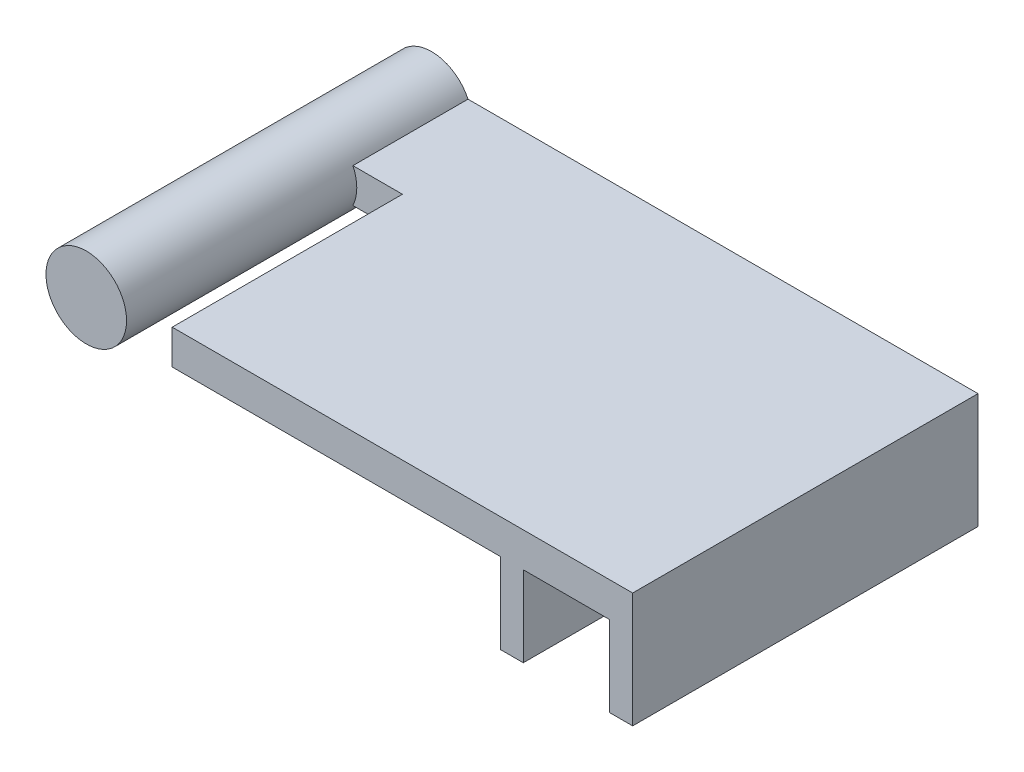
ISO-10303-21;
HEADER;
FILE_DESCRIPTION(('STEP AP214'),'2;1');
FILE_NAME('part.step','',(''),(''),'','','');
FILE_SCHEMA(('AUTOMOTIVE_DESIGN { 1 0 10303 214 1 1 1 1 }'));
ENDSEC;
DATA;
#1=APPLICATION_CONTEXT('core data for automotive mechanical design processes');
#2=APPLICATION_PROTOCOL_DEFINITION('international standard','automotive_design',2000,#1);
#3=PRODUCT_CONTEXT('',#1,'mechanical');
#4=PRODUCT('Part','Part','',(#3));
#5=PRODUCT_RELATED_PRODUCT_CATEGORY('part','',(#4));
#6=PRODUCT_DEFINITION_FORMATION('','',#4);
#7=PRODUCT_DEFINITION_CONTEXT('part definition',#1,'design');
#8=PRODUCT_DEFINITION('design','',#6,#7);
#9=PRODUCT_DEFINITION_SHAPE('','',#8);
#10=(LENGTH_UNIT() NAMED_UNIT(*) SI_UNIT(.MILLI.,.METRE.));
#11=(NAMED_UNIT(*) PLANE_ANGLE_UNIT() SI_UNIT($,.RADIAN.));
#12=(NAMED_UNIT(*) SI_UNIT($,.STERADIAN.) SOLID_ANGLE_UNIT());
#13=UNCERTAINTY_MEASURE_WITH_UNIT(LENGTH_MEASURE(1.E-05),#10,'distance_accuracy_value','');
#14=(GEOMETRIC_REPRESENTATION_CONTEXT(3) GLOBAL_UNCERTAINTY_ASSIGNED_CONTEXT((#13)) GLOBAL_UNIT_ASSIGNED_CONTEXT((#10,
#11,#12)) REPRESENTATION_CONTEXT('',''));
#15=CARTESIAN_POINT('',(0.,0.,0.));
#16=DIRECTION('',(0.,0.,1.));
#17=DIRECTION('',(1.,0.,0.));
#18=AXIS2_PLACEMENT_3D('',#15,#16,#17);
#19=CARTESIAN_POINT('',(-20.,1.5,30.));
#20=DIRECTION('',(0.,-1.,0.));
#21=DIRECTION('',(0.,0.,-1.));
#22=AXIS2_PLACEMENT_3D('',#19,#20,#21);
#23=PLANE('',#22);
#24=DIRECTION('',(0.,0.,-1.));
#25=VECTOR('',#24,1.);
#26=CARTESIAN_POINT('',(-24.3028652580677,1.5,30.));
#27=LINE('',#26,#25);
#28=CARTESIAN_POINT('',(-24.3028652580677,1.5,10.));
#29=VERTEX_POINT('',#28);
#30=CARTESIAN_POINT('',(-24.3028652580677,1.5,0.));
#31=VERTEX_POINT('',#30);
#32=EDGE_CURVE('E119',#29,#31,#27,.T.);
#33=ORIENTED_EDGE('',*,*,#32,.F.);
#34=DIRECTION('',(-1.,0.,0.));
#35=VECTOR('',#34,1.);
#36=CARTESIAN_POINT('',(-20.,1.5,10.));
#37=LINE('',#36,#35);
#38=CARTESIAN_POINT('',(-20.,1.5,10.));
#39=VERTEX_POINT('',#38);
#40=EDGE_CURVE('E144',#39,#29,#37,.T.);
#41=ORIENTED_EDGE('',*,*,#40,.F.);
#42=DIRECTION('',(0.,0.,-1.));
#43=VECTOR('',#42,1.);
#44=CARTESIAN_POINT('',(-20.,1.5,30.));
#45=LINE('',#44,#43);
#46=CARTESIAN_POINT('',(-20.,1.5,30.));
#47=VERTEX_POINT('',#46);
#48=EDGE_CURVE('E188',#47,#39,#45,.T.);
#49=ORIENTED_EDGE('',*,*,#48,.F.);
#50=DIRECTION('',(-1.,0.,0.));
#51=VECTOR('',#50,1.);
#52=CARTESIAN_POINT('',(-20.,1.5,30.));
#53=LINE('',#52,#51);
#54=CARTESIAN_POINT('',(20.,1.5,30.));
#55=VERTEX_POINT('',#54);
#56=EDGE_CURVE('E202',#55,#47,#53,.T.);
#57=ORIENTED_EDGE('',*,*,#56,.F.);
#58=DIRECTION('',(0.,0.,-1.));
#59=VECTOR('',#58,1.);
#60=CARTESIAN_POINT('',(20.,1.5,30.));
#61=LINE('',#60,#59);
#62=CARTESIAN_POINT('',(20.,1.5,0.));
#63=VERTEX_POINT('',#62);
#64=EDGE_CURVE('E40',#55,#63,#61,.T.);
#65=ORIENTED_EDGE('',*,*,#64,.T.);
#66=DIRECTION('',(-1.,0.,0.));
#67=VECTOR('',#66,1.);
#68=CARTESIAN_POINT('',(-20.,1.5,0.));
#69=LINE('',#68,#67);
#70=EDGE_CURVE('E134',#63,#31,#69,.T.);
#71=ORIENTED_EDGE('',*,*,#70,.T.);
#72=EDGE_LOOP('',(#33,#41,#49,#57,#65,#71));
#73=FACE_BOUND('',#72,.T.);
#74=ADVANCED_FACE('F33',(#73),#23,.F.);
#75=CARTESIAN_POINT('',(-20.,-1.5,30.));
#76=DIRECTION('',(0.,1.,0.));
#77=DIRECTION('',(-1.,0.,0.));
#78=AXIS2_PLACEMENT_3D('',#75,#76,#77);
#79=PLANE('',#78);
#80=DIRECTION('',(0.,0.,-1.));
#81=VECTOR('',#80,1.);
#82=CARTESIAN_POINT('',(-24.3028652580677,-1.5,30.));
#83=LINE('',#82,#81);
#84=CARTESIAN_POINT('',(-24.3028652580677,-1.5,0.));
#85=VERTEX_POINT('',#84);
#86=CARTESIAN_POINT('',(-24.3028652580677,-1.5,10.));
#87=VERTEX_POINT('',#86);
#88=EDGE_CURVE('E47',#85,#87,#83,.F.);
#89=ORIENTED_EDGE('',*,*,#88,.F.);
#90=DIRECTION('',(1.,0.,0.));
#91=VECTOR('',#90,1.);
#92=CARTESIAN_POINT('',(-20.,-1.5,0.));
#93=LINE('',#92,#91);
#94=CARTESIAN_POINT('',(8.5,-1.5,0.));
#95=VERTEX_POINT('',#94);
#96=EDGE_CURVE('E137',#85,#95,#93,.T.);
#97=ORIENTED_EDGE('',*,*,#96,.T.);
#98=DIRECTION('',(0.,0.,-1.));
#99=VECTOR('',#98,1.);
#100=CARTESIAN_POINT('',(8.5,-1.5,30.));
#101=LINE('',#100,#99);
#102=CARTESIAN_POINT('',(8.5,-1.5,30.));
#103=VERTEX_POINT('',#102);
#104=EDGE_CURVE('E182',#103,#95,#101,.T.);
#105=ORIENTED_EDGE('',*,*,#104,.F.);
#106=DIRECTION('',(1.,0.,0.));
#107=VECTOR('',#106,1.);
#108=CARTESIAN_POINT('',(-20.,-1.5,30.));
#109=LINE('',#108,#107);
#110=CARTESIAN_POINT('',(-20.,-1.5,30.));
#111=VERTEX_POINT('',#110);
#112=EDGE_CURVE('E205',#111,#103,#109,.T.);
#113=ORIENTED_EDGE('',*,*,#112,.F.);
#114=DIRECTION('',(0.,0.,-1.));
#115=VECTOR('',#114,1.);
#116=CARTESIAN_POINT('',(-20.,-1.5,30.));
#117=LINE('',#116,#115);
#118=CARTESIAN_POINT('',(-20.,-1.5,10.));
#119=VERTEX_POINT('',#118);
#120=EDGE_CURVE('E185',#111,#119,#117,.T.);
#121=ORIENTED_EDGE('',*,*,#120,.T.);
#122=DIRECTION('',(1.,0.,0.));
#123=VECTOR('',#122,1.);
#124=CARTESIAN_POINT('',(-20.,-1.5,10.));
#125=LINE('',#124,#123);
#126=EDGE_CURVE('E53',#87,#119,#125,.T.);
#127=ORIENTED_EDGE('',*,*,#126,.F.);
#128=EDGE_LOOP('',(#89,#97,#105,#113,#121,#127));
#129=FACE_BOUND('',#128,.T.);
#130=ADVANCED_FACE('F252',(#129),#79,.F.);
#131=CARTESIAN_POINT('',(-20.,-1.5,30.));
#132=DIRECTION('',(1.,0.,0.));
#133=DIRECTION('',(0.,0.,-1.));
#134=AXIS2_PLACEMENT_3D('',#131,#132,#133);
#135=PLANE('',#134);
#136=DIRECTION('',(0.,1.,0.));
#137=VECTOR('',#136,1.);
#138=CARTESIAN_POINT('',(-20.,-1.5,10.));
#139=LINE('',#138,#137);
#140=EDGE_CURVE('E127',#119,#39,#139,.T.);
#141=ORIENTED_EDGE('',*,*,#140,.F.);
#142=ORIENTED_EDGE('',*,*,#120,.F.);
#143=DIRECTION('',(0.,-1.,0.));
#144=VECTOR('',#143,1.);
#145=CARTESIAN_POINT('',(-20.,-1.5,30.));
#146=LINE('',#145,#144);
#147=EDGE_CURVE('E194',#47,#111,#146,.T.);
#148=ORIENTED_EDGE('',*,*,#147,.F.);
#149=ORIENTED_EDGE('',*,*,#48,.T.);
#150=EDGE_LOOP('',(#141,#142,#148,#149));
#151=FACE_BOUND('',#150,.T.);
#152=ADVANCED_FACE('F192',(#151),#135,.F.);
#153=CARTESIAN_POINT('',(8.5,-8.5,30.));
#154=DIRECTION('',(1.,0.,0.));
#155=DIRECTION('',(0.,0.,-1.));
#156=AXIS2_PLACEMENT_3D('',#153,#154,#155);
#157=PLANE('',#156);
#158=DIRECTION('',(0.,-1.,0.));
#159=VECTOR('',#158,1.);
#160=CARTESIAN_POINT('',(8.5,-8.5,0.));
#161=LINE('',#160,#159);
#162=CARTESIAN_POINT('',(8.5,-8.5,0.));
#163=VERTEX_POINT('',#162);
#164=EDGE_CURVE('E142',#95,#163,#161,.T.);
#165=ORIENTED_EDGE('',*,*,#164,.T.);
#166=DIRECTION('',(0.,0.,-1.));
#167=VECTOR('',#166,1.);
#168=CARTESIAN_POINT('',(8.5,-8.5,30.));
#169=LINE('',#168,#167);
#170=CARTESIAN_POINT('',(8.5,-8.5,30.));
#171=VERTEX_POINT('',#170);
#172=EDGE_CURVE('E179',#171,#163,#169,.T.);
#173=ORIENTED_EDGE('',*,*,#172,.F.);
#174=DIRECTION('',(0.,-1.,0.));
#175=VECTOR('',#174,1.);
#176=CARTESIAN_POINT('',(8.5,-8.5,30.));
#177=LINE('',#176,#175);
#178=EDGE_CURVE('E207',#103,#171,#177,.T.);
#179=ORIENTED_EDGE('',*,*,#178,.F.);
#180=ORIENTED_EDGE('',*,*,#104,.T.);
#181=EDGE_LOOP('',(#165,#173,#179,#180));
#182=FACE_BOUND('',#181,.T.);
#183=ADVANCED_FACE('F248',(#182),#157,.F.);
#184=CARTESIAN_POINT('',(10.5,-8.5,30.));
#185=DIRECTION('',(0.,1.,0.));
#186=DIRECTION('',(-1.,0.,0.));
#187=AXIS2_PLACEMENT_3D('',#184,#185,#186);
#188=PLANE('',#187);
#189=DIRECTION('',(1.,0.,0.));
#190=VECTOR('',#189,1.);
#191=CARTESIAN_POINT('',(10.5,-8.5,0.));
#192=LINE('',#191,#190);
#193=CARTESIAN_POINT('',(10.5,-8.5,0.));
#194=VERTEX_POINT('',#193);
#195=EDGE_CURVE('E151',#163,#194,#192,.T.);
#196=ORIENTED_EDGE('',*,*,#195,.T.);
#197=DIRECTION('',(0.,0.,-1.));
#198=VECTOR('',#197,1.);
#199=CARTESIAN_POINT('',(10.5,-8.5,30.));
#200=LINE('',#199,#198);
#201=CARTESIAN_POINT('',(10.5,-8.5,30.));
#202=VERTEX_POINT('',#201);
#203=EDGE_CURVE('E176',#202,#194,#200,.T.);
#204=ORIENTED_EDGE('',*,*,#203,.F.);
#205=DIRECTION('',(1.,0.,0.));
#206=VECTOR('',#205,1.);
#207=CARTESIAN_POINT('',(10.5,-8.5,30.));
#208=LINE('',#207,#206);
#209=EDGE_CURVE('E209',#171,#202,#208,.T.);
#210=ORIENTED_EDGE('',*,*,#209,.F.);
#211=ORIENTED_EDGE('',*,*,#172,.T.);
#212=EDGE_LOOP('',(#196,#204,#210,#211));
#213=FACE_BOUND('',#212,.T.);
#214=ADVANCED_FACE('F243',(#213),#188,.F.);
#215=CARTESIAN_POINT('',(10.5,-8.5,30.));
#216=DIRECTION('',(-1.,0.,0.));
#217=DIRECTION('',(0.,0.,1.));
#218=AXIS2_PLACEMENT_3D('',#215,#216,#217);
#219=PLANE('',#218);
#220=DIRECTION('',(0.,1.,0.));
#221=VECTOR('',#220,1.);
#222=CARTESIAN_POINT('',(10.5,-8.5,0.));
#223=LINE('',#222,#221);
#224=CARTESIAN_POINT('',(10.5,-1.5,0.));
#225=VERTEX_POINT('',#224);
#226=EDGE_CURVE('E153',#194,#225,#223,.T.);
#227=ORIENTED_EDGE('',*,*,#226,.T.);
#228=DIRECTION('',(0.,0.,-1.));
#229=VECTOR('',#228,1.);
#230=CARTESIAN_POINT('',(10.5,-1.5,30.));
#231=LINE('',#230,#229);
#232=CARTESIAN_POINT('',(10.5,-1.5,30.));
#233=VERTEX_POINT('',#232);
#234=EDGE_CURVE('E173',#233,#225,#231,.T.);
#235=ORIENTED_EDGE('',*,*,#234,.F.);
#236=DIRECTION('',(0.,1.,0.));
#237=VECTOR('',#236,1.);
#238=CARTESIAN_POINT('',(10.5,-8.5,30.));
#239=LINE('',#238,#237);
#240=EDGE_CURVE('E211',#202,#233,#239,.T.);
#241=ORIENTED_EDGE('',*,*,#240,.F.);
#242=ORIENTED_EDGE('',*,*,#203,.T.);
#243=EDGE_LOOP('',(#227,#235,#241,#242));
#244=FACE_BOUND('',#243,.T.);
#245=ADVANCED_FACE('F239',(#244),#219,.F.);
#246=CARTESIAN_POINT('',(10.5,-1.5,30.));
#247=DIRECTION('',(0.,1.,0.));
#248=DIRECTION('',(-1.,0.,0.));
#249=AXIS2_PLACEMENT_3D('',#246,#247,#248);
#250=PLANE('',#249);
#251=DIRECTION('',(1.,0.,0.));
#252=VECTOR('',#251,1.);
#253=CARTESIAN_POINT('',(10.5,-1.5,0.));
#254=LINE('',#253,#252);
#255=CARTESIAN_POINT('',(18.,-1.5,0.));
#256=VERTEX_POINT('',#255);
#257=EDGE_CURVE('E155',#225,#256,#254,.T.);
#258=ORIENTED_EDGE('',*,*,#257,.T.);
#259=DIRECTION('',(0.,0.,-1.));
#260=VECTOR('',#259,1.);
#261=CARTESIAN_POINT('',(18.,-1.5,30.));
#262=LINE('',#261,#260);
#263=CARTESIAN_POINT('',(18.,-1.5,30.));
#264=VERTEX_POINT('',#263);
#265=EDGE_CURVE('E170',#264,#256,#262,.T.);
#266=ORIENTED_EDGE('',*,*,#265,.F.);
#267=DIRECTION('',(1.,0.,0.));
#268=VECTOR('',#267,1.);
#269=CARTESIAN_POINT('',(10.5,-1.5,30.));
#270=LINE('',#269,#268);
#271=EDGE_CURVE('E213',#233,#264,#270,.T.);
#272=ORIENTED_EDGE('',*,*,#271,.F.);
#273=ORIENTED_EDGE('',*,*,#234,.T.);
#274=EDGE_LOOP('',(#258,#266,#272,#273));
#275=FACE_BOUND('',#274,.T.);
#276=ADVANCED_FACE('F235',(#275),#250,.F.);
#277=CARTESIAN_POINT('',(18.,-1.5,30.));
#278=DIRECTION('',(1.,0.,0.));
#279=DIRECTION('',(0.,0.,-1.));
#280=AXIS2_PLACEMENT_3D('',#277,#278,#279);
#281=PLANE('',#280);
#282=DIRECTION('',(0.,-1.,0.));
#283=VECTOR('',#282,1.);
#284=CARTESIAN_POINT('',(18.,-1.5,0.));
#285=LINE('',#284,#283);
#286=CARTESIAN_POINT('',(18.,-8.5,0.));
#287=VERTEX_POINT('',#286);
#288=EDGE_CURVE('E157',#256,#287,#285,.T.);
#289=ORIENTED_EDGE('',*,*,#288,.T.);
#290=DIRECTION('',(0.,0.,-1.));
#291=VECTOR('',#290,1.);
#292=CARTESIAN_POINT('',(18.,-8.5,30.));
#293=LINE('',#292,#291);
#294=CARTESIAN_POINT('',(18.,-8.5,30.));
#295=VERTEX_POINT('',#294);
#296=EDGE_CURVE('E167',#295,#287,#293,.T.);
#297=ORIENTED_EDGE('',*,*,#296,.F.);
#298=DIRECTION('',(0.,-1.,0.));
#299=VECTOR('',#298,1.);
#300=CARTESIAN_POINT('',(18.,-1.5,30.));
#301=LINE('',#300,#299);
#302=EDGE_CURVE('E214',#264,#295,#301,.T.);
#303=ORIENTED_EDGE('',*,*,#302,.F.);
#304=ORIENTED_EDGE('',*,*,#265,.T.);
#305=EDGE_LOOP('',(#289,#297,#303,#304));
#306=FACE_BOUND('',#305,.T.);
#307=ADVANCED_FACE('F231',(#306),#281,.F.);
#308=CARTESIAN_POINT('',(20.,-8.5,30.));
#309=DIRECTION('',(0.,1.,0.));
#310=DIRECTION('',(0.,0.,1.));
#311=AXIS2_PLACEMENT_3D('',#308,#309,#310);
#312=PLANE('',#311);
#313=DIRECTION('',(1.,0.,0.));
#314=VECTOR('',#313,1.);
#315=CARTESIAN_POINT('',(20.,-8.5,0.));
#316=LINE('',#315,#314);
#317=CARTESIAN_POINT('',(20.,-8.5,0.));
#318=VERTEX_POINT('',#317);
#319=EDGE_CURVE('E159',#287,#318,#316,.T.);
#320=ORIENTED_EDGE('',*,*,#319,.T.);
#321=DIRECTION('',(0.,0.,-1.));
#322=VECTOR('',#321,1.);
#323=CARTESIAN_POINT('',(20.,-8.5,30.));
#324=LINE('',#323,#322);
#325=CARTESIAN_POINT('',(20.,-8.5,30.));
#326=VERTEX_POINT('',#325);
#327=EDGE_CURVE('E164',#326,#318,#324,.T.);
#328=ORIENTED_EDGE('',*,*,#327,.F.);
#329=DIRECTION('',(1.,0.,0.));
#330=VECTOR('',#329,1.);
#331=CARTESIAN_POINT('',(20.,-8.5,30.));
#332=LINE('',#331,#330);
#333=EDGE_CURVE('E147',#295,#326,#332,.T.);
#334=ORIENTED_EDGE('',*,*,#333,.F.);
#335=ORIENTED_EDGE('',*,*,#296,.T.);
#336=EDGE_LOOP('',(#320,#328,#334,#335));
#337=FACE_BOUND('',#336,.T.);
#338=ADVANCED_FACE('F223',(#337),#312,.F.);
#339=CARTESIAN_POINT('',(20.,-1.5,30.));
#340=DIRECTION('',(-1.,0.,0.));
#341=DIRECTION('',(0.,0.,1.));
#342=AXIS2_PLACEMENT_3D('',#339,#340,#341);
#343=PLANE('',#342);
#344=DIRECTION('',(0.,1.,0.));
#345=VECTOR('',#344,1.);
#346=CARTESIAN_POINT('',(20.,-1.5,0.));
#347=LINE('',#346,#345);
#348=EDGE_CURVE('E161',#318,#63,#347,.T.);
#349=ORIENTED_EDGE('',*,*,#348,.T.);
#350=ORIENTED_EDGE('',*,*,#64,.F.);
#351=DIRECTION('',(0.,1.,0.));
#352=VECTOR('',#351,1.);
#353=CARTESIAN_POINT('',(20.,-1.5,30.));
#354=LINE('',#353,#352);
#355=EDGE_CURVE('E163',#326,#55,#354,.T.);
#356=ORIENTED_EDGE('',*,*,#355,.F.);
#357=ORIENTED_EDGE('',*,*,#327,.T.);
#358=EDGE_LOOP('',(#349,#350,#356,#357));
#359=FACE_BOUND('',#358,.T.);
#360=ADVANCED_FACE('F226',(#359),#343,.F.);
#361=CARTESIAN_POINT('',(0.,0.,30.));
#362=DIRECTION('',(0.,0.,-1.));
#363=DIRECTION('',(-1.,0.,0.));
#364=AXIS2_PLACEMENT_3D('',#361,#362,#363);
#365=PLANE('',#364);
#366=ORIENTED_EDGE('',*,*,#355,.T.);
#367=ORIENTED_EDGE('',*,*,#56,.T.);
#368=ORIENTED_EDGE('',*,*,#147,.T.);
#369=ORIENTED_EDGE('',*,*,#112,.T.);
#370=ORIENTED_EDGE('',*,*,#178,.T.);
#371=ORIENTED_EDGE('',*,*,#209,.T.);
#372=ORIENTED_EDGE('',*,*,#240,.T.);
#373=ORIENTED_EDGE('',*,*,#271,.T.);
#374=ORIENTED_EDGE('',*,*,#302,.T.);
#375=ORIENTED_EDGE('',*,*,#333,.T.);
#376=EDGE_LOOP('',(#366,#367,#368,#369,#370,#371,#372,#373,#374,#375));
#377=FACE_BOUND('',#376,.T.);
#378=ADVANCED_FACE('F221',(#377),#365,.F.);
#379=CARTESIAN_POINT('',(0.,0.,0.));
#380=DIRECTION('',(0.,0.,-1.));
#381=DIRECTION('',(-1.,0.,0.));
#382=AXIS2_PLACEMENT_3D('',#379,#380,#381);
#383=PLANE('',#382);
#384=ORIENTED_EDGE('',*,*,#96,.F.);
#385=CARTESIAN_POINT('',(-27.4651429182361,0.,0.));
#386=DIRECTION('',(0.,0.,1.));
#387=DIRECTION('',(1.,0.,0.));
#388=AXIS2_PLACEMENT_3D('',#385,#386,#387);
#389=CIRCLE('',#388,3.5);
#390=EDGE_CURVE('E122',#31,#85,#389,.T.);
#391=ORIENTED_EDGE('',*,*,#390,.F.);
#392=ORIENTED_EDGE('',*,*,#70,.F.);
#393=ORIENTED_EDGE('',*,*,#348,.F.);
#394=ORIENTED_EDGE('',*,*,#319,.F.);
#395=ORIENTED_EDGE('',*,*,#288,.F.);
#396=ORIENTED_EDGE('',*,*,#257,.F.);
#397=ORIENTED_EDGE('',*,*,#226,.F.);
#398=ORIENTED_EDGE('',*,*,#195,.F.);
#399=ORIENTED_EDGE('',*,*,#164,.F.);
#400=EDGE_LOOP('',(#384,#391,#392,#393,#394,#395,#396,#397,#398,#399));
#401=FACE_BOUND('',#400,.T.);
#402=ADVANCED_FACE('F132',(#401),#383,.T.);
#403=CARTESIAN_POINT('',(0.,0.,10.));
#404=DIRECTION('',(0.,0.,1.));
#405=DIRECTION('',(1.,0.,0.));
#406=AXIS2_PLACEMENT_3D('',#403,#404,#405);
#407=PLANE('',#406);
#408=ORIENTED_EDGE('',*,*,#40,.T.);
#409=CARTESIAN_POINT('',(-27.4651429182361,0.,10.));
#410=DIRECTION('',(0.,0.,1.));
#411=DIRECTION('',(1.,0.,0.));
#412=AXIS2_PLACEMENT_3D('',#409,#410,#411);
#413=CIRCLE('',#412,3.5);
#414=EDGE_CURVE('E11',#29,#87,#413,.F.);
#415=ORIENTED_EDGE('',*,*,#414,.T.);
#416=ORIENTED_EDGE('',*,*,#126,.T.);
#417=ORIENTED_EDGE('',*,*,#140,.T.);
#418=EDGE_LOOP('',(#408,#415,#416,#417));
#419=FACE_BOUND('',#418,.T.);
#420=ADVANCED_FACE('F196',(#419),#407,.T.);
#421=CARTESIAN_POINT('',(-27.4651429182361,0.,30.));
#422=DIRECTION('',(0.,0.,-1.));
#423=DIRECTION('',(-1.,0.,0.));
#424=AXIS2_PLACEMENT_3D('',#421,#422,#423);
#425=CYLINDRICAL_SURFACE('',#424,3.5);
#426=CARTESIAN_POINT('',(-27.4651429182361,0.,30.));
#427=DIRECTION('',(0.,0.,1.));
#428=DIRECTION('',(1.,0.,0.));
#429=AXIS2_PLACEMENT_3D('',#426,#427,#428);
#430=CIRCLE('',#429,3.5);
#431=CARTESIAN_POINT('',(-23.9651429182361,0.,30.));
#432=VERTEX_POINT('',#431);
#433=EDGE_CURVE('E138',#432,#432,#430,.T.);
#434=ORIENTED_EDGE('',*,*,#433,.F.);
#435=EDGE_LOOP('',(#434));
#436=FACE_BOUND('',#435,.T.);
#437=ORIENTED_EDGE('',*,*,#414,.F.);
#438=ORIENTED_EDGE('',*,*,#32,.T.);
#439=ORIENTED_EDGE('',*,*,#390,.T.);
#440=ORIENTED_EDGE('',*,*,#88,.T.);
#441=EDGE_LOOP('',(#437,#438,#439,#440));
#442=FACE_BOUND('',#441,.T.);
#443=ADVANCED_FACE('F121',(#436,#442),#425,.T.);
#444=CARTESIAN_POINT('',(-27.4651429182361,0.,30.));
#445=DIRECTION('',(0.,0.,1.));
#446=DIRECTION('',(1.,0.,0.));
#447=AXIS2_PLACEMENT_3D('',#444,#445,#446);
#448=PLANE('',#447);
#449=ORIENTED_EDGE('',*,*,#433,.T.);
#450=EDGE_LOOP('',(#449));
#451=FACE_BOUND('',#450,.T.);
#452=ADVANCED_FACE('F257',(#451),#448,.T.);
#453=CLOSED_SHELL('',(#74,#130,#152,#183,#214,#245,#276,#307,#338,#360,#378,#402,#420,#443,#452));
#454=MANIFOLD_SOLID_BREP('B2',#453);
#455=ADVANCED_BREP_SHAPE_REPRESENTATION('',(#18,#454),#14);
#456=SHAPE_DEFINITION_REPRESENTATION(#9,#455);
ENDSEC;
END-ISO-10303-21;
